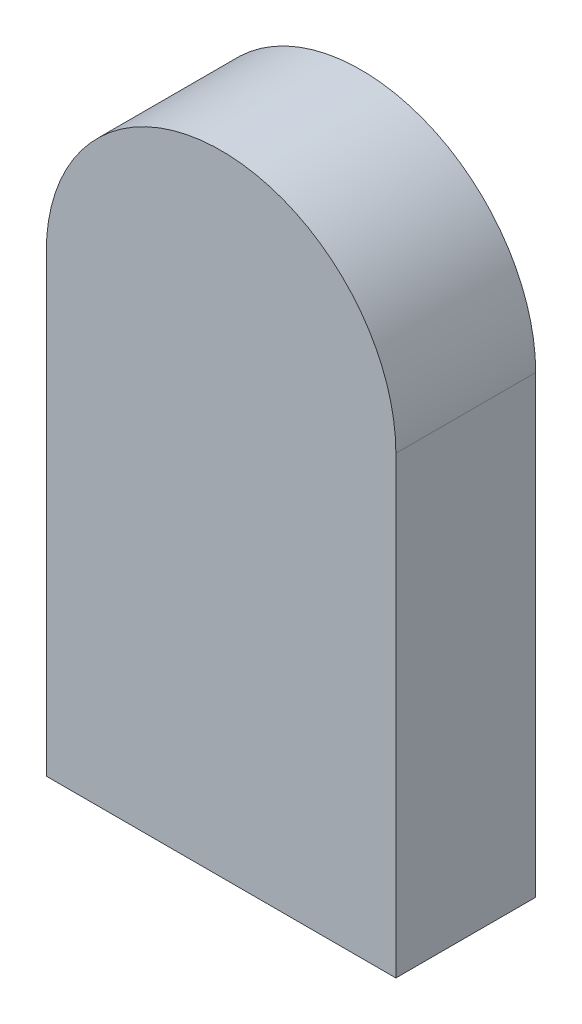
ISO-10303-21;
HEADER;
FILE_DESCRIPTION(('STEP AP214'),'2;1');
FILE_NAME('part.step','',(''),(''),'','','');
FILE_SCHEMA(('AUTOMOTIVE_DESIGN { 1 0 10303 214 1 1 1 1 }'));
ENDSEC;
DATA;
#1=APPLICATION_CONTEXT('core data for automotive mechanical design processes');
#2=APPLICATION_PROTOCOL_DEFINITION('international standard','automotive_design',2000,#1);
#3=PRODUCT_CONTEXT('',#1,'mechanical');
#4=PRODUCT('Part','Part','',(#3));
#5=PRODUCT_RELATED_PRODUCT_CATEGORY('part','',(#4));
#6=PRODUCT_DEFINITION_FORMATION('','',#4);
#7=PRODUCT_DEFINITION_CONTEXT('part definition',#1,'design');
#8=PRODUCT_DEFINITION('design','',#6,#7);
#9=PRODUCT_DEFINITION_SHAPE('','',#8);
#10=(LENGTH_UNIT() NAMED_UNIT(*) SI_UNIT(.MILLI.,.METRE.));
#11=(NAMED_UNIT(*) PLANE_ANGLE_UNIT() SI_UNIT($,.RADIAN.));
#12=(NAMED_UNIT(*) SI_UNIT($,.STERADIAN.) SOLID_ANGLE_UNIT());
#13=UNCERTAINTY_MEASURE_WITH_UNIT(LENGTH_MEASURE(1.E-05),#10,'distance_accuracy_value','');
#14=(GEOMETRIC_REPRESENTATION_CONTEXT(3) GLOBAL_UNCERTAINTY_ASSIGNED_CONTEXT((#13)) GLOBAL_UNIT_ASSIGNED_CONTEXT((#10,
#11,#12)) REPRESENTATION_CONTEXT('',''));
#15=CARTESIAN_POINT('',(0.,0.,0.));
#16=DIRECTION('',(0.,0.,1.));
#17=DIRECTION('',(1.,0.,0.));
#18=AXIS2_PLACEMENT_3D('',#15,#16,#17);
#19=CARTESIAN_POINT('',(-1.375,-2.05,0.));
#20=DIRECTION('',(0.,1.,0.));
#21=DIRECTION('',(1.,0.,0.));
#22=AXIS2_PLACEMENT_3D('',#19,#20,#21);
#23=PLANE('',#22);
#24=DIRECTION('',(1.,0.,0.));
#25=VECTOR('',#24,1.);
#26=CARTESIAN_POINT('',(-1.375,-2.05,0.));
#27=LINE('',#26,#25);
#28=CARTESIAN_POINT('',(-1.375,-2.05,0.));
#29=VERTEX_POINT('',#28);
#30=CARTESIAN_POINT('',(-1.125,-2.05,0.));
#31=VERTEX_POINT('',#30);
#32=EDGE_CURVE('E11',#29,#31,#27,.T.);
#33=ORIENTED_EDGE('',*,*,#32,.T.);
#34=DIRECTION('',(0.,0.,1.));
#35=VECTOR('',#34,1.);
#36=CARTESIAN_POINT('',(-1.125,-2.05,0.));
#37=LINE('',#36,#35);
#38=CARTESIAN_POINT('',(-1.125,-2.05,0.1));
#39=VERTEX_POINT('',#38);
#40=EDGE_CURVE('E24',#31,#39,#37,.T.);
#41=ORIENTED_EDGE('',*,*,#40,.T.);
#42=DIRECTION('',(1.,0.,0.));
#43=VECTOR('',#42,1.);
#44=CARTESIAN_POINT('',(-1.375,-2.05,0.1));
#45=LINE('',#44,#43);
#46=CARTESIAN_POINT('',(-1.375,-2.05,0.1));
#47=VERTEX_POINT('',#46);
#48=EDGE_CURVE('E87',#47,#39,#45,.T.);
#49=ORIENTED_EDGE('',*,*,#48,.F.);
#50=DIRECTION('',(0.,0.,1.));
#51=VECTOR('',#50,1.);
#52=CARTESIAN_POINT('',(-1.375,-2.05,0.));
#53=LINE('',#52,#51);
#54=EDGE_CURVE('E36',#29,#47,#53,.T.);
#55=ORIENTED_EDGE('',*,*,#54,.F.);
#56=EDGE_LOOP('',(#33,#41,#49,#55));
#57=FACE_BOUND('',#56,.T.);
#58=ADVANCED_FACE('F17',(#57),#23,.F.);
#59=CARTESIAN_POINT('',(-1.125,-2.05,0.));
#60=DIRECTION('',(-1.,0.,0.));
#61=DIRECTION('',(0.,1.,0.));
#62=AXIS2_PLACEMENT_3D('',#59,#60,#61);
#63=PLANE('',#62);
#64=DIRECTION('',(0.,1.,0.));
#65=VECTOR('',#64,1.);
#66=CARTESIAN_POINT('',(-1.125,-2.05,0.));
#67=LINE('',#66,#65);
#68=CARTESIAN_POINT('',(-1.125,-1.725,0.));
#69=VERTEX_POINT('',#68);
#70=EDGE_CURVE('E84',#31,#69,#67,.T.);
#71=ORIENTED_EDGE('',*,*,#70,.T.);
#72=DIRECTION('',(0.,0.,1.));
#73=VECTOR('',#72,1.);
#74=CARTESIAN_POINT('',(-1.125,-1.725,0.));
#75=LINE('',#74,#73);
#76=CARTESIAN_POINT('',(-1.125,-1.725,0.1));
#77=VERTEX_POINT('',#76);
#78=EDGE_CURVE('E82',#69,#77,#75,.T.);
#79=ORIENTED_EDGE('',*,*,#78,.T.);
#80=DIRECTION('',(0.,1.,0.));
#81=VECTOR('',#80,1.);
#82=CARTESIAN_POINT('',(-1.125,-2.05,0.1));
#83=LINE('',#82,#81);
#84=EDGE_CURVE('E72',#39,#77,#83,.T.);
#85=ORIENTED_EDGE('',*,*,#84,.F.);
#86=ORIENTED_EDGE('',*,*,#40,.F.);
#87=EDGE_LOOP('',(#71,#79,#85,#86));
#88=FACE_BOUND('',#87,.T.);
#89=ADVANCED_FACE('F89',(#88),#63,.F.);
#90=CARTESIAN_POINT('',(-1.25,-1.725,0.));
#91=DIRECTION('',(0.,0.,-1.));
#92=DIRECTION('',(1.,0.,0.));
#93=AXIS2_PLACEMENT_3D('',#90,#91,#92);
#94=CYLINDRICAL_SURFACE('',#93,0.125);
#95=CARTESIAN_POINT('',(-1.25,-1.725,0.));
#96=DIRECTION('',(0.,0.,1.));
#97=DIRECTION('',(1.,0.,0.));
#98=AXIS2_PLACEMENT_3D('',#95,#96,#97);
#99=CIRCLE('',#98,0.125);
#100=CARTESIAN_POINT('',(-1.375,-1.725,0.));
#101=VERTEX_POINT('',#100);
#102=EDGE_CURVE('E62',#69,#101,#99,.T.);
#103=ORIENTED_EDGE('',*,*,#102,.T.);
#104=DIRECTION('',(0.,0.,1.));
#105=VECTOR('',#104,1.);
#106=CARTESIAN_POINT('',(-1.375,-1.725,0.));
#107=LINE('',#106,#105);
#108=CARTESIAN_POINT('',(-1.375,-1.725,0.1));
#109=VERTEX_POINT('',#108);
#110=EDGE_CURVE('E57',#101,#109,#107,.T.);
#111=ORIENTED_EDGE('',*,*,#110,.T.);
#112=CARTESIAN_POINT('',(-1.25,-1.725,0.1));
#113=DIRECTION('',(0.,0.,1.));
#114=DIRECTION('',(1.,0.,0.));
#115=AXIS2_PLACEMENT_3D('',#112,#113,#114);
#116=CIRCLE('',#115,0.125);
#117=EDGE_CURVE('E60',#77,#109,#116,.T.);
#118=ORIENTED_EDGE('',*,*,#117,.F.);
#119=ORIENTED_EDGE('',*,*,#78,.F.);
#120=EDGE_LOOP('',(#103,#111,#118,#119));
#121=FACE_BOUND('',#120,.T.);
#122=ADVANCED_FACE('F59',(#121),#94,.T.);
#123=CARTESIAN_POINT('',(-1.375,-2.05,0.));
#124=DIRECTION('',(-1.,0.,0.));
#125=DIRECTION('',(0.,1.,0.));
#126=AXIS2_PLACEMENT_3D('',#123,#124,#125);
#127=PLANE('',#126);
#128=ORIENTED_EDGE('',*,*,#54,.T.);
#129=DIRECTION('',(0.,1.,0.));
#130=VECTOR('',#129,1.);
#131=CARTESIAN_POINT('',(-1.375,-2.05,0.1));
#132=LINE('',#131,#130);
#133=EDGE_CURVE('E71',#47,#109,#132,.T.);
#134=ORIENTED_EDGE('',*,*,#133,.T.);
#135=ORIENTED_EDGE('',*,*,#110,.F.);
#136=DIRECTION('',(0.,1.,0.));
#137=VECTOR('',#136,1.);
#138=CARTESIAN_POINT('',(-1.375,-2.05,0.));
#139=LINE('',#138,#137);
#140=EDGE_CURVE('E76',#29,#101,#139,.T.);
#141=ORIENTED_EDGE('',*,*,#140,.F.);
#142=EDGE_LOOP('',(#128,#134,#135,#141));
#143=FACE_BOUND('',#142,.T.);
#144=ADVANCED_FACE('F75',(#143),#127,.T.);
#145=CARTESIAN_POINT('',(-1.25,-1.850342514613,0.));
#146=DIRECTION('',(0.,0.,1.));
#147=DIRECTION('',(1.,0.,0.));
#148=AXIS2_PLACEMENT_3D('',#145,#146,#147);
#149=PLANE('',#148);
#150=ORIENTED_EDGE('',*,*,#140,.T.);
#151=ORIENTED_EDGE('',*,*,#102,.F.);
#152=ORIENTED_EDGE('',*,*,#70,.F.);
#153=ORIENTED_EDGE('',*,*,#32,.F.);
#154=EDGE_LOOP('',(#150,#151,#152,#153));
#155=FACE_BOUND('',#154,.T.);
#156=ADVANCED_FACE('F91',(#155),#149,.F.);
#157=CARTESIAN_POINT('',(-1.25,-1.850342514613,0.1));
#158=DIRECTION('',(0.,0.,1.));
#159=DIRECTION('',(1.,0.,0.));
#160=AXIS2_PLACEMENT_3D('',#157,#158,#159);
#161=PLANE('',#160);
#162=ORIENTED_EDGE('',*,*,#48,.T.);
#163=ORIENTED_EDGE('',*,*,#84,.T.);
#164=ORIENTED_EDGE('',*,*,#117,.T.);
#165=ORIENTED_EDGE('',*,*,#133,.F.);
#166=EDGE_LOOP('',(#162,#163,#164,#165));
#167=FACE_BOUND('',#166,.T.);
#168=ADVANCED_FACE('F70',(#167),#161,.T.);
#169=CLOSED_SHELL('',(#58,#89,#122,#144,#156,#168));
#170=MANIFOLD_SOLID_BREP('B1',#169);
#171=ADVANCED_BREP_SHAPE_REPRESENTATION('',(#18,#170),#14);
#172=SHAPE_DEFINITION_REPRESENTATION(#9,#171);
ENDSEC;
END-ISO-10303-21;
